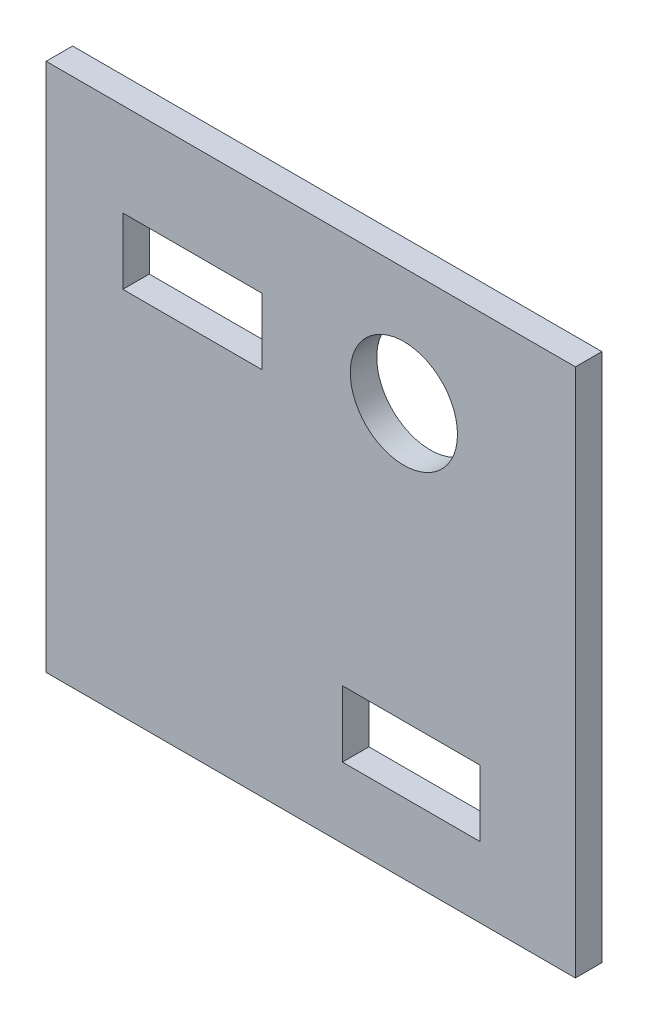
ISO-10303-21;
HEADER;
FILE_DESCRIPTION(('STEP AP214'),'2;1');
FILE_NAME('part.step','',(''),(''),'','','');
FILE_SCHEMA(('AUTOMOTIVE_DESIGN { 1 0 10303 214 1 1 1 1 }'));
ENDSEC;
DATA;
#1=APPLICATION_CONTEXT('core data for automotive mechanical design processes');
#2=APPLICATION_PROTOCOL_DEFINITION('international standard','automotive_design',2000,#1);
#3=PRODUCT_CONTEXT('',#1,'mechanical');
#4=PRODUCT('Part','Part','',(#3));
#5=PRODUCT_RELATED_PRODUCT_CATEGORY('part','',(#4));
#6=PRODUCT_DEFINITION_FORMATION('','',#4);
#7=PRODUCT_DEFINITION_CONTEXT('part definition',#1,'design');
#8=PRODUCT_DEFINITION('design','',#6,#7);
#9=PRODUCT_DEFINITION_SHAPE('','',#8);
#10=(LENGTH_UNIT() NAMED_UNIT(*) SI_UNIT(.MILLI.,.METRE.));
#11=(NAMED_UNIT(*) PLANE_ANGLE_UNIT() SI_UNIT($,.RADIAN.));
#12=(NAMED_UNIT(*) SI_UNIT($,.STERADIAN.) SOLID_ANGLE_UNIT());
#13=UNCERTAINTY_MEASURE_WITH_UNIT(LENGTH_MEASURE(1.E-05),#10,'distance_accuracy_value','');
#14=(GEOMETRIC_REPRESENTATION_CONTEXT(3) GLOBAL_UNCERTAINTY_ASSIGNED_CONTEXT((#13)) GLOBAL_UNIT_ASSIGNED_CONTEXT((#10,
#11,#12)) REPRESENTATION_CONTEXT('',''));
#15=CARTESIAN_POINT('',(0.,0.,0.));
#16=DIRECTION('',(0.,0.,1.));
#17=DIRECTION('',(1.,0.,0.));
#18=AXIS2_PLACEMENT_3D('',#15,#16,#17);
#19=CARTESIAN_POINT('',(-17.3953488372093,14.6511627906977,2.));
#20=DIRECTION('',(1.,0.,0.));
#21=DIRECTION('',(0.,1.,0.));
#22=AXIS2_PLACEMENT_3D('',#19,#20,#21);
#23=PLANE('',#22);
#24=DIRECTION('',(0.,-1.,0.));
#25=VECTOR('',#24,1.);
#26=CARTESIAN_POINT('',(-17.3953488372093,14.6511627906977,0.));
#27=LINE('',#26,#25);
#28=CARTESIAN_POINT('',(-17.3953488372093,14.6511627906977,0.));
#29=VERTEX_POINT('',#28);
#30=CARTESIAN_POINT('',(-17.3953488372093,-25.3488372093023,0.));
#31=VERTEX_POINT('',#30);
#32=EDGE_CURVE('E158',#29,#31,#27,.T.);
#33=ORIENTED_EDGE('',*,*,#32,.T.);
#34=DIRECTION('',(0.,0.,-1.));
#35=VECTOR('',#34,1.);
#36=CARTESIAN_POINT('',(-17.3953488372093,-25.3488372093023,2.));
#37=LINE('',#36,#35);
#38=CARTESIAN_POINT('',(-17.3953488372093,-25.3488372093023,2.));
#39=VERTEX_POINT('',#38);
#40=EDGE_CURVE('E11',#39,#31,#37,.T.);
#41=ORIENTED_EDGE('',*,*,#40,.F.);
#42=DIRECTION('',(0.,-1.,0.));
#43=VECTOR('',#42,1.);
#44=CARTESIAN_POINT('',(-17.3953488372093,14.6511627906977,2.));
#45=LINE('',#44,#43);
#46=CARTESIAN_POINT('',(-17.3953488372093,14.6511627906977,2.));
#47=VERTEX_POINT('',#46);
#48=EDGE_CURVE('E197',#47,#39,#45,.T.);
#49=ORIENTED_EDGE('',*,*,#48,.F.);
#50=DIRECTION('',(0.,0.,-1.));
#51=VECTOR('',#50,1.);
#52=CARTESIAN_POINT('',(-17.3953488372093,14.6511627906977,2.));
#53=LINE('',#52,#51);
#54=EDGE_CURVE('E207',#47,#29,#53,.T.);
#55=ORIENTED_EDGE('',*,*,#54,.T.);
#56=EDGE_LOOP('',(#33,#41,#49,#55));
#57=FACE_BOUND('',#56,.T.);
#58=ADVANCED_FACE('F33',(#57),#23,.F.);
#59=CARTESIAN_POINT('',(-17.3953488372093,-25.3488372093023,2.));
#60=DIRECTION('',(0.,1.,0.));
#61=DIRECTION('',(0.,0.,1.));
#62=AXIS2_PLACEMENT_3D('',#59,#60,#61);
#63=PLANE('',#62);
#64=DIRECTION('',(1.,0.,0.));
#65=VECTOR('',#64,1.);
#66=CARTESIAN_POINT('',(-17.3953488372093,-25.3488372093023,0.));
#67=LINE('',#66,#65);
#68=CARTESIAN_POINT('',(22.6046511627907,-25.3488372093023,0.));
#69=VERTEX_POINT('',#68);
#70=EDGE_CURVE('E210',#31,#69,#67,.T.);
#71=ORIENTED_EDGE('',*,*,#70,.T.);
#72=DIRECTION('',(0.,0.,-1.));
#73=VECTOR('',#72,1.);
#74=CARTESIAN_POINT('',(22.6046511627907,-25.3488372093023,2.));
#75=LINE('',#74,#73);
#76=CARTESIAN_POINT('',(22.6046511627907,-25.3488372093023,2.));
#77=VERTEX_POINT('',#76);
#78=EDGE_CURVE('E40',#77,#69,#75,.T.);
#79=ORIENTED_EDGE('',*,*,#78,.F.);
#80=DIRECTION('',(1.,0.,0.));
#81=VECTOR('',#80,1.);
#82=CARTESIAN_POINT('',(-17.3953488372093,-25.3488372093023,2.));
#83=LINE('',#82,#81);
#84=EDGE_CURVE('E200',#39,#77,#83,.T.);
#85=ORIENTED_EDGE('',*,*,#84,.F.);
#86=ORIENTED_EDGE('',*,*,#40,.T.);
#87=EDGE_LOOP('',(#71,#79,#85,#86));
#88=FACE_BOUND('',#87,.T.);
#89=ADVANCED_FACE('F239',(#88),#63,.F.);
#90=CARTESIAN_POINT('',(22.6046511627907,14.6511627906977,2.));
#91=DIRECTION('',(-1.,0.,0.));
#92=DIRECTION('',(0.,0.,1.));
#93=AXIS2_PLACEMENT_3D('',#90,#91,#92);
#94=PLANE('',#93);
#95=DIRECTION('',(0.,1.,0.));
#96=VECTOR('',#95,1.);
#97=CARTESIAN_POINT('',(22.6046511627907,14.6511627906977,0.));
#98=LINE('',#97,#96);
#99=CARTESIAN_POINT('',(22.6046511627907,14.6511627906977,0.));
#100=VERTEX_POINT('',#99);
#101=EDGE_CURVE('E212',#69,#100,#98,.T.);
#102=ORIENTED_EDGE('',*,*,#101,.T.);
#103=DIRECTION('',(0.,0.,-1.));
#104=VECTOR('',#103,1.);
#105=CARTESIAN_POINT('',(22.6046511627907,14.6511627906977,2.));
#106=LINE('',#105,#104);
#107=CARTESIAN_POINT('',(22.6046511627907,14.6511627906977,2.));
#108=VERTEX_POINT('',#107);
#109=EDGE_CURVE('E217',#108,#100,#106,.T.);
#110=ORIENTED_EDGE('',*,*,#109,.F.);
#111=DIRECTION('',(0.,1.,0.));
#112=VECTOR('',#111,1.);
#113=CARTESIAN_POINT('',(22.6046511627907,14.6511627906977,2.));
#114=LINE('',#113,#112);
#115=EDGE_CURVE('E203',#77,#108,#114,.T.);
#116=ORIENTED_EDGE('',*,*,#115,.F.);
#117=ORIENTED_EDGE('',*,*,#78,.T.);
#118=EDGE_LOOP('',(#102,#110,#116,#117));
#119=FACE_BOUND('',#118,.T.);
#120=ADVANCED_FACE('F224',(#119),#94,.F.);
#121=CARTESIAN_POINT('',(-17.3953488372093,14.6511627906977,2.));
#122=DIRECTION('',(0.,-1.,0.));
#123=DIRECTION('',(0.,0.,-1.));
#124=AXIS2_PLACEMENT_3D('',#121,#122,#123);
#125=PLANE('',#124);
#126=DIRECTION('',(-1.,0.,0.));
#127=VECTOR('',#126,1.);
#128=CARTESIAN_POINT('',(-17.3953488372093,14.6511627906977,0.));
#129=LINE('',#128,#127);
#130=EDGE_CURVE('E201',#100,#29,#129,.T.);
#131=ORIENTED_EDGE('',*,*,#130,.T.);
#132=ORIENTED_EDGE('',*,*,#54,.F.);
#133=DIRECTION('',(-1.,0.,0.));
#134=VECTOR('',#133,1.);
#135=CARTESIAN_POINT('',(-17.3953488372093,14.6511627906977,2.));
#136=LINE('',#135,#134);
#137=EDGE_CURVE('E205',#108,#47,#136,.T.);
#138=ORIENTED_EDGE('',*,*,#137,.F.);
#139=ORIENTED_EDGE('',*,*,#109,.T.);
#140=EDGE_LOOP('',(#131,#132,#138,#139));
#141=FACE_BOUND('',#140,.T.);
#142=ADVANCED_FACE('F232',(#141),#125,.F.);
#143=CARTESIAN_POINT('',(0.,0.,2.));
#144=DIRECTION('',(0.,0.,1.));
#145=DIRECTION('',(1.,0.,0.));
#146=AXIS2_PLACEMENT_3D('',#143,#144,#145);
#147=PLANE('',#146);
#148=DIRECTION('',(0.,-1.,0.));
#149=VECTOR('',#148,1.);
#150=CARTESIAN_POINT('',(-11.5996396859446,7.62224959592572,2.));
#151=LINE('',#150,#149);
#152=CARTESIAN_POINT('',(-11.5996396859446,7.62224959592572,2.));
#153=VERTEX_POINT('',#152);
#154=CARTESIAN_POINT('',(-11.5996396859446,2.62224959592572,2.));
#155=VERTEX_POINT('',#154);
#156=EDGE_CURVE('E47',#153,#155,#151,.T.);
#157=ORIENTED_EDGE('',*,*,#156,.F.);
#158=DIRECTION('',(-1.,0.,0.));
#159=VECTOR('',#158,1.);
#160=CARTESIAN_POINT('',(-11.5996396859446,7.62224959592572,2.));
#161=LINE('',#160,#159);
#162=CARTESIAN_POINT('',(-1.09963968594457,7.62224959592572,2.));
#163=VERTEX_POINT('',#162);
#164=EDGE_CURVE('E142',#163,#153,#161,.T.);
#165=ORIENTED_EDGE('',*,*,#164,.F.);
#166=DIRECTION('',(0.,1.,0.));
#167=VECTOR('',#166,1.);
#168=CARTESIAN_POINT('',(-1.09963968594457,7.62224959592572,2.));
#169=LINE('',#168,#167);
#170=CARTESIAN_POINT('',(-1.09963968594457,2.62224959592572,2.));
#171=VERTEX_POINT('',#170);
#172=EDGE_CURVE('E145',#171,#163,#169,.T.);
#173=ORIENTED_EDGE('',*,*,#172,.F.);
#174=DIRECTION('',(1.,0.,0.));
#175=VECTOR('',#174,1.);
#176=CARTESIAN_POINT('',(-11.5996396859446,2.62224959592572,2.));
#177=LINE('',#176,#175);
#178=EDGE_CURVE('E151',#155,#171,#177,.T.);
#179=ORIENTED_EDGE('',*,*,#178,.F.);
#180=EDGE_LOOP('',(#157,#165,#173,#179));
#181=FACE_BOUND('',#180,.T.);
#182=DIRECTION('',(0.,-1.,0.));
#183=VECTOR('',#182,1.);
#184=CARTESIAN_POINT('',(4.99863309396353,-15.0221696993356,2.));
#185=LINE('',#184,#183);
#186=CARTESIAN_POINT('',(4.99863309396353,-15.0221696993356,2.));
#187=VERTEX_POINT('',#186);
#188=CARTESIAN_POINT('',(4.99863309396354,-20.0221696993356,2.));
#189=VERTEX_POINT('',#188);
#190=EDGE_CURVE('E55',#187,#189,#185,.T.);
#191=ORIENTED_EDGE('',*,*,#190,.F.);
#192=DIRECTION('',(-1.,0.,0.));
#193=VECTOR('',#192,1.);
#194=CARTESIAN_POINT('',(4.99863309396353,-15.0221696993356,2.));
#195=LINE('',#194,#193);
#196=CARTESIAN_POINT('',(15.3986330939635,-15.0221696993356,2.));
#197=VERTEX_POINT('',#196);
#198=EDGE_CURVE('E166',#197,#187,#195,.T.);
#199=ORIENTED_EDGE('',*,*,#198,.F.);
#200=DIRECTION('',(0.,1.,0.));
#201=VECTOR('',#200,1.);
#202=CARTESIAN_POINT('',(15.3986330939635,-15.0221696993356,2.));
#203=LINE('',#202,#201);
#204=CARTESIAN_POINT('',(15.3986330939635,-20.0221696993356,2.));
#205=VERTEX_POINT('',#204);
#206=EDGE_CURVE('E181',#205,#197,#203,.T.);
#207=ORIENTED_EDGE('',*,*,#206,.F.);
#208=DIRECTION('',(1.,0.,0.));
#209=VECTOR('',#208,1.);
#210=CARTESIAN_POINT('',(4.99863309396354,-20.0221696993356,2.));
#211=LINE('',#210,#209);
#212=EDGE_CURVE('E177',#189,#205,#211,.T.);
#213=ORIENTED_EDGE('',*,*,#212,.F.);
#214=EDGE_LOOP('',(#191,#199,#207,#213));
#215=FACE_BOUND('',#214,.T.);
#216=CARTESIAN_POINT('',(9.64087980831607,5.77503939449286,2.));
#217=DIRECTION('',(0.,0.,1.));
#218=DIRECTION('',(1.,0.,0.));
#219=AXIS2_PLACEMENT_3D('',#216,#217,#218);
#220=CIRCLE('',#219,4.05120919428479);
#221=CARTESIAN_POINT('',(13.6920890026009,5.77503939449286,2.));
#222=VERTEX_POINT('',#221);
#223=EDGE_CURVE('E194',#222,#222,#220,.T.);
#224=ORIENTED_EDGE('',*,*,#223,.F.);
#225=EDGE_LOOP('',(#224));
#226=FACE_BOUND('',#225,.T.);
#227=ORIENTED_EDGE('',*,*,#48,.T.);
#228=ORIENTED_EDGE('',*,*,#84,.T.);
#229=ORIENTED_EDGE('',*,*,#115,.T.);
#230=ORIENTED_EDGE('',*,*,#137,.T.);
#231=EDGE_LOOP('',(#227,#228,#229,#230));
#232=FACE_BOUND('',#231,.T.);
#233=ADVANCED_FACE('F238',(#181,#215,#226,#232),#147,.T.);
#234=CARTESIAN_POINT('',(0.,0.,0.));
#235=DIRECTION('',(0.,0.,1.));
#236=DIRECTION('',(1.,0.,0.));
#237=AXIS2_PLACEMENT_3D('',#234,#235,#236);
#238=PLANE('',#237);
#239=DIRECTION('',(-1.,0.,0.));
#240=VECTOR('',#239,1.);
#241=CARTESIAN_POINT('',(-11.5996396859446,7.62224959592572,0.));
#242=LINE('',#241,#240);
#243=CARTESIAN_POINT('',(-1.09963968594457,7.62224959592572,0.));
#244=VERTEX_POINT('',#243);
#245=CARTESIAN_POINT('',(-11.5996396859446,7.62224959592572,0.));
#246=VERTEX_POINT('',#245);
#247=EDGE_CURVE('E129',#244,#246,#242,.T.);
#248=ORIENTED_EDGE('',*,*,#247,.T.);
#249=DIRECTION('',(0.,-1.,0.));
#250=VECTOR('',#249,1.);
#251=CARTESIAN_POINT('',(-11.5996396859446,7.62224959592572,0.));
#252=LINE('',#251,#250);
#253=CARTESIAN_POINT('',(-11.5996396859446,2.62224959592572,0.));
#254=VERTEX_POINT('',#253);
#255=EDGE_CURVE('E123',#246,#254,#252,.T.);
#256=ORIENTED_EDGE('',*,*,#255,.T.);
#257=DIRECTION('',(1.,0.,0.));
#258=VECTOR('',#257,1.);
#259=CARTESIAN_POINT('',(-11.5996396859446,2.62224959592572,0.));
#260=LINE('',#259,#258);
#261=CARTESIAN_POINT('',(-1.09963968594457,2.62224959592572,0.));
#262=VERTEX_POINT('',#261);
#263=EDGE_CURVE('E133',#254,#262,#260,.T.);
#264=ORIENTED_EDGE('',*,*,#263,.T.);
#265=DIRECTION('',(0.,1.,0.));
#266=VECTOR('',#265,1.);
#267=CARTESIAN_POINT('',(-1.09963968594457,7.62224959592572,0.));
#268=LINE('',#267,#266);
#269=EDGE_CURVE('E137',#262,#244,#268,.T.);
#270=ORIENTED_EDGE('',*,*,#269,.T.);
#271=EDGE_LOOP('',(#248,#256,#264,#270));
#272=FACE_BOUND('',#271,.T.);
#273=DIRECTION('',(-1.,0.,0.));
#274=VECTOR('',#273,1.);
#275=CARTESIAN_POINT('',(4.99863309396353,-15.0221696993356,0.));
#276=LINE('',#275,#274);
#277=CARTESIAN_POINT('',(15.3986330939635,-15.0221696993356,0.));
#278=VERTEX_POINT('',#277);
#279=CARTESIAN_POINT('',(4.99863309396353,-15.0221696993356,0.));
#280=VERTEX_POINT('',#279);
#281=EDGE_CURVE('E172',#278,#280,#276,.T.);
#282=ORIENTED_EDGE('',*,*,#281,.T.);
#283=DIRECTION('',(0.,-1.,0.));
#284=VECTOR('',#283,1.);
#285=CARTESIAN_POINT('',(4.99863309396353,-15.0221696993356,0.));
#286=LINE('',#285,#284);
#287=CARTESIAN_POINT('',(4.99863309396354,-20.0221696993356,0.));
#288=VERTEX_POINT('',#287);
#289=EDGE_CURVE('E162',#280,#288,#286,.T.);
#290=ORIENTED_EDGE('',*,*,#289,.T.);
#291=DIRECTION('',(1.,0.,0.));
#292=VECTOR('',#291,1.);
#293=CARTESIAN_POINT('',(4.99863309396354,-20.0221696993356,0.));
#294=LINE('',#293,#292);
#295=CARTESIAN_POINT('',(15.3986330939635,-20.0221696993356,0.));
#296=VERTEX_POINT('',#295);
#297=EDGE_CURVE('E165',#288,#296,#294,.T.);
#298=ORIENTED_EDGE('',*,*,#297,.T.);
#299=DIRECTION('',(0.,1.,0.));
#300=VECTOR('',#299,1.);
#301=CARTESIAN_POINT('',(15.3986330939635,-15.0221696993356,0.));
#302=LINE('',#301,#300);
#303=EDGE_CURVE('E169',#296,#278,#302,.T.);
#304=ORIENTED_EDGE('',*,*,#303,.T.);
#305=EDGE_LOOP('',(#282,#290,#298,#304));
#306=FACE_BOUND('',#305,.T.);
#307=CARTESIAN_POINT('',(9.64087980831607,5.77503939449286,0.));
#308=DIRECTION('',(0.,0.,1.));
#309=DIRECTION('',(1.,0.,0.));
#310=AXIS2_PLACEMENT_3D('',#307,#308,#309);
#311=CIRCLE('',#310,4.05120919428479);
#312=CARTESIAN_POINT('',(13.6920890026009,5.77503939449286,0.));
#313=VERTEX_POINT('',#312);
#314=EDGE_CURVE('E178',#313,#313,#311,.T.);
#315=ORIENTED_EDGE('',*,*,#314,.T.);
#316=EDGE_LOOP('',(#315));
#317=FACE_BOUND('',#316,.T.);
#318=ORIENTED_EDGE('',*,*,#32,.F.);
#319=ORIENTED_EDGE('',*,*,#130,.F.);
#320=ORIENTED_EDGE('',*,*,#101,.F.);
#321=ORIENTED_EDGE('',*,*,#70,.F.);
#322=EDGE_LOOP('',(#318,#319,#320,#321));
#323=FACE_BOUND('',#322,.T.);
#324=ADVANCED_FACE('F139',(#272,#306,#317,#323),#238,.F.);
#325=CARTESIAN_POINT('',(9.64087980831607,5.77503939449286,0.));
#326=DIRECTION('',(0.,0.,1.));
#327=DIRECTION('',(1.,0.,0.));
#328=AXIS2_PLACEMENT_3D('',#325,#326,#327);
#329=CYLINDRICAL_SURFACE('',#328,4.05120919428479);
#330=ORIENTED_EDGE('',*,*,#314,.F.);
#331=EDGE_LOOP('',(#330));
#332=FACE_BOUND('',#331,.T.);
#333=ORIENTED_EDGE('',*,*,#223,.T.);
#334=EDGE_LOOP('',(#333));
#335=FACE_BOUND('',#334,.T.);
#336=ADVANCED_FACE('F251',(#332,#335),#329,.F.);
#337=CARTESIAN_POINT('',(4.99863309396353,-15.0221696993356,0.));
#338=DIRECTION('',(-1.,0.,0.));
#339=DIRECTION('',(0.,-1.,0.));
#340=AXIS2_PLACEMENT_3D('',#337,#338,#339);
#341=PLANE('',#340);
#342=ORIENTED_EDGE('',*,*,#190,.T.);
#343=DIRECTION('',(0.,0.,1.));
#344=VECTOR('',#343,1.);
#345=CARTESIAN_POINT('',(4.99863309396354,-20.0221696993356,0.));
#346=LINE('',#345,#344);
#347=EDGE_CURVE('E175',#288,#189,#346,.T.);
#348=ORIENTED_EDGE('',*,*,#347,.F.);
#349=ORIENTED_EDGE('',*,*,#289,.F.);
#350=DIRECTION('',(0.,0.,1.));
#351=VECTOR('',#350,1.);
#352=CARTESIAN_POINT('',(4.99863309396353,-15.0221696993356,0.));
#353=LINE('',#352,#351);
#354=EDGE_CURVE('E152',#280,#187,#353,.T.);
#355=ORIENTED_EDGE('',*,*,#354,.T.);
#356=EDGE_LOOP('',(#342,#348,#349,#355));
#357=FACE_BOUND('',#356,.T.);
#358=ADVANCED_FACE('F257',(#357),#341,.F.);
#359=CARTESIAN_POINT('',(4.99863309396353,-15.0221696993356,0.));
#360=DIRECTION('',(0.,1.,0.));
#361=DIRECTION('',(0.,0.,1.));
#362=AXIS2_PLACEMENT_3D('',#359,#360,#361);
#363=PLANE('',#362);
#364=ORIENTED_EDGE('',*,*,#198,.T.);
#365=ORIENTED_EDGE('',*,*,#354,.F.);
#366=ORIENTED_EDGE('',*,*,#281,.F.);
#367=DIRECTION('',(0.,0.,1.));
#368=VECTOR('',#367,1.);
#369=CARTESIAN_POINT('',(15.3986330939635,-15.0221696993356,0.));
#370=LINE('',#369,#368);
#371=EDGE_CURVE('E187',#278,#197,#370,.T.);
#372=ORIENTED_EDGE('',*,*,#371,.T.);
#373=EDGE_LOOP('',(#364,#365,#366,#372));
#374=FACE_BOUND('',#373,.T.);
#375=ADVANCED_FACE('F261',(#374),#363,.F.);
#376=CARTESIAN_POINT('',(15.3986330939635,-15.0221696993356,0.));
#377=DIRECTION('',(1.,0.,0.));
#378=DIRECTION('',(0.,0.,-1.));
#379=AXIS2_PLACEMENT_3D('',#376,#377,#378);
#380=PLANE('',#379);
#381=ORIENTED_EDGE('',*,*,#206,.T.);
#382=ORIENTED_EDGE('',*,*,#371,.F.);
#383=ORIENTED_EDGE('',*,*,#303,.F.);
#384=DIRECTION('',(0.,0.,1.));
#385=VECTOR('',#384,1.);
#386=CARTESIAN_POINT('',(15.3986330939635,-20.0221696993356,0.));
#387=LINE('',#386,#385);
#388=EDGE_CURVE('E189',#296,#205,#387,.T.);
#389=ORIENTED_EDGE('',*,*,#388,.T.);
#390=EDGE_LOOP('',(#381,#382,#383,#389));
#391=FACE_BOUND('',#390,.T.);
#392=ADVANCED_FACE('F265',(#391),#380,.F.);
#393=CARTESIAN_POINT('',(4.99863309396354,-20.0221696993356,0.));
#394=DIRECTION('',(0.,-1.,0.));
#395=DIRECTION('',(0.,0.,-1.));
#396=AXIS2_PLACEMENT_3D('',#393,#394,#395);
#397=PLANE('',#396);
#398=ORIENTED_EDGE('',*,*,#212,.T.);
#399=ORIENTED_EDGE('',*,*,#388,.F.);
#400=ORIENTED_EDGE('',*,*,#297,.F.);
#401=ORIENTED_EDGE('',*,*,#347,.T.);
#402=EDGE_LOOP('',(#398,#399,#400,#401));
#403=FACE_BOUND('',#402,.T.);
#404=ADVANCED_FACE('F262',(#403),#397,.F.);
#405=CARTESIAN_POINT('',(-11.5996396859446,7.62224959592572,0.));
#406=DIRECTION('',(-1.,0.,0.));
#407=DIRECTION('',(0.,0.,1.));
#408=AXIS2_PLACEMENT_3D('',#405,#406,#407);
#409=PLANE('',#408);
#410=ORIENTED_EDGE('',*,*,#156,.T.);
#411=DIRECTION('',(0.,0.,1.));
#412=VECTOR('',#411,1.);
#413=CARTESIAN_POINT('',(-11.5996396859446,2.62224959592572,0.));
#414=LINE('',#413,#412);
#415=EDGE_CURVE('E119',#254,#155,#414,.T.);
#416=ORIENTED_EDGE('',*,*,#415,.F.);
#417=ORIENTED_EDGE('',*,*,#255,.F.);
#418=DIRECTION('',(0.,0.,1.));
#419=VECTOR('',#418,1.);
#420=CARTESIAN_POINT('',(-11.5996396859446,7.62224959592572,0.));
#421=LINE('',#420,#419);
#422=EDGE_CURVE('E156',#246,#153,#421,.T.);
#423=ORIENTED_EDGE('',*,*,#422,.T.);
#424=EDGE_LOOP('',(#410,#416,#417,#423));
#425=FACE_BOUND('',#424,.T.);
#426=ADVANCED_FACE('F121',(#425),#409,.F.);
#427=CARTESIAN_POINT('',(-11.5996396859446,7.62224959592572,0.));
#428=DIRECTION('',(0.,1.,0.));
#429=DIRECTION('',(0.,0.,1.));
#430=AXIS2_PLACEMENT_3D('',#427,#428,#429);
#431=PLANE('',#430);
#432=ORIENTED_EDGE('',*,*,#164,.T.);
#433=ORIENTED_EDGE('',*,*,#422,.F.);
#434=ORIENTED_EDGE('',*,*,#247,.F.);
#435=DIRECTION('',(0.,0.,1.));
#436=VECTOR('',#435,1.);
#437=CARTESIAN_POINT('',(-1.09963968594457,7.62224959592572,0.));
#438=LINE('',#437,#436);
#439=EDGE_CURVE('E159',#244,#163,#438,.T.);
#440=ORIENTED_EDGE('',*,*,#439,.T.);
#441=EDGE_LOOP('',(#432,#433,#434,#440));
#442=FACE_BOUND('',#441,.T.);
#443=ADVANCED_FACE('F275',(#442),#431,.F.);
#444=CARTESIAN_POINT('',(-1.09963968594457,7.62224959592572,0.));
#445=DIRECTION('',(1.,0.,0.));
#446=DIRECTION('',(0.,1.,0.));
#447=AXIS2_PLACEMENT_3D('',#444,#445,#446);
#448=PLANE('',#447);
#449=ORIENTED_EDGE('',*,*,#172,.T.);
#450=ORIENTED_EDGE('',*,*,#439,.F.);
#451=ORIENTED_EDGE('',*,*,#269,.F.);
#452=DIRECTION('',(0.,0.,1.));
#453=VECTOR('',#452,1.);
#454=CARTESIAN_POINT('',(-1.09963968594457,2.62224959592572,0.));
#455=LINE('',#454,#453);
#456=EDGE_CURVE('E128',#262,#171,#455,.T.);
#457=ORIENTED_EDGE('',*,*,#456,.T.);
#458=EDGE_LOOP('',(#449,#450,#451,#457));
#459=FACE_BOUND('',#458,.T.);
#460=ADVANCED_FACE('F278',(#459),#448,.F.);
#461=CARTESIAN_POINT('',(-11.5996396859446,2.62224959592572,0.));
#462=DIRECTION('',(0.,-1.,0.));
#463=DIRECTION('',(0.,0.,-1.));
#464=AXIS2_PLACEMENT_3D('',#461,#462,#463);
#465=PLANE('',#464);
#466=ORIENTED_EDGE('',*,*,#178,.T.);
#467=ORIENTED_EDGE('',*,*,#456,.F.);
#468=ORIENTED_EDGE('',*,*,#263,.F.);
#469=ORIENTED_EDGE('',*,*,#415,.T.);
#470=EDGE_LOOP('',(#466,#467,#468,#469));
#471=FACE_BOUND('',#470,.T.);
#472=ADVANCED_FACE('F134',(#471),#465,.F.);
#473=CLOSED_SHELL('',(#58,#89,#120,#142,#233,#324,#336,#358,#375,#392,#404,#426,#443,#460,#472));
#474=MANIFOLD_SOLID_BREP('B2',#473);
#475=ADVANCED_BREP_SHAPE_REPRESENTATION('',(#18,#474),#14);
#476=SHAPE_DEFINITION_REPRESENTATION(#9,#475);
ENDSEC;
END-ISO-10303-21;
